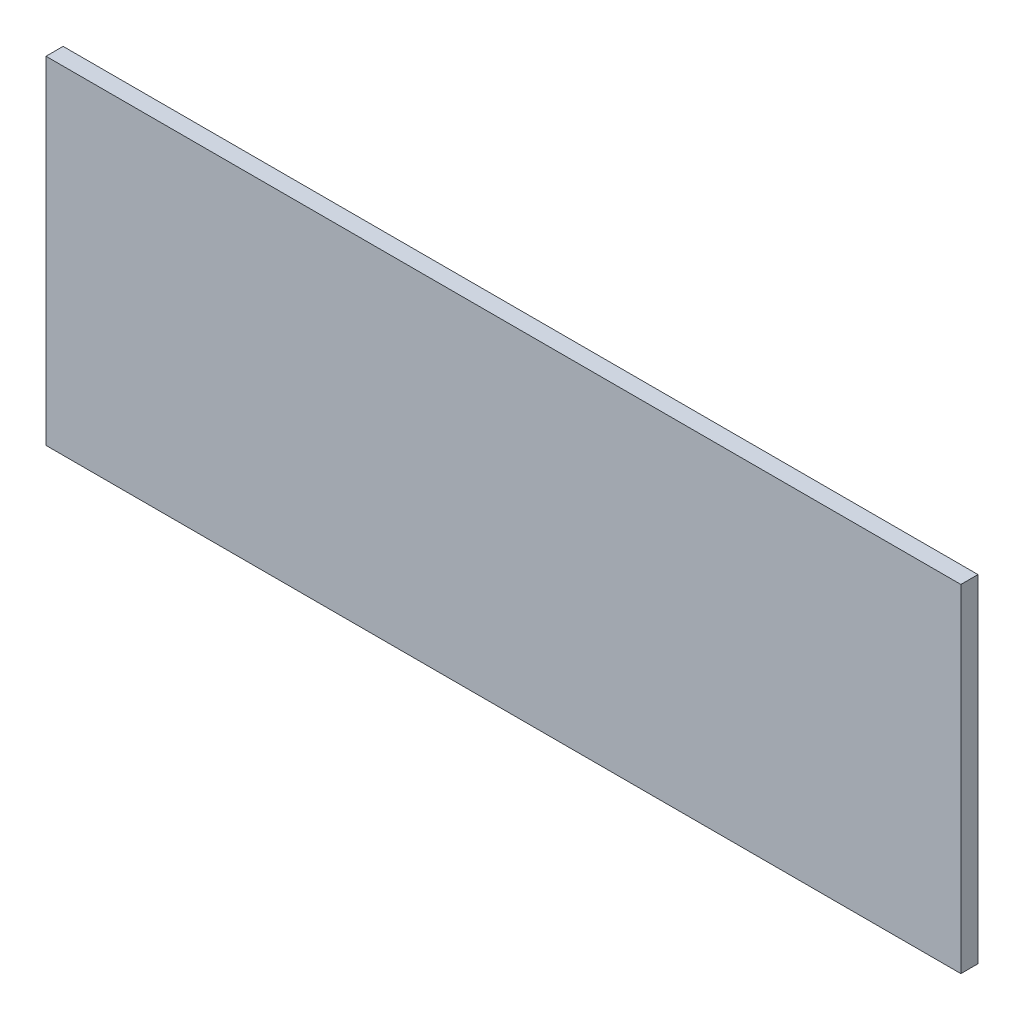
ISO-10303-21;
HEADER;
FILE_DESCRIPTION(('STEP AP214'),'2;1');
FILE_NAME('part.step','',(''),(''),'','','');
FILE_SCHEMA(('AUTOMOTIVE_DESIGN { 1 0 10303 214 1 1 1 1 }'));
ENDSEC;
DATA;
#1=APPLICATION_CONTEXT('core data for automotive mechanical design processes');
#2=APPLICATION_PROTOCOL_DEFINITION('international standard','automotive_design',2000,#1);
#3=PRODUCT_CONTEXT('',#1,'mechanical');
#4=PRODUCT('Part','Part','',(#3));
#5=PRODUCT_RELATED_PRODUCT_CATEGORY('part','',(#4));
#6=PRODUCT_DEFINITION_FORMATION('','',#4);
#7=PRODUCT_DEFINITION_CONTEXT('part definition',#1,'design');
#8=PRODUCT_DEFINITION('design','',#6,#7);
#9=PRODUCT_DEFINITION_SHAPE('','',#8);
#10=(LENGTH_UNIT() NAMED_UNIT(*) SI_UNIT(.MILLI.,.METRE.));
#11=(NAMED_UNIT(*) PLANE_ANGLE_UNIT() SI_UNIT($,.RADIAN.));
#12=(NAMED_UNIT(*) SI_UNIT($,.STERADIAN.) SOLID_ANGLE_UNIT());
#13=UNCERTAINTY_MEASURE_WITH_UNIT(LENGTH_MEASURE(1.E-05),#10,'distance_accuracy_value','');
#14=(GEOMETRIC_REPRESENTATION_CONTEXT(3) GLOBAL_UNCERTAINTY_ASSIGNED_CONTEXT((#13)) GLOBAL_UNIT_ASSIGNED_CONTEXT((#10,
#11,#12)) REPRESENTATION_CONTEXT('',''));
#15=CARTESIAN_POINT('',(0.,0.,0.));
#16=DIRECTION('',(0.,0.,1.));
#17=DIRECTION('',(1.,0.,0.));
#18=AXIS2_PLACEMENT_3D('',#15,#16,#17);
#19=CARTESIAN_POINT('',(96.5670013427734,67.5869979858398,0.));
#20=DIRECTION('',(0.,1.,0.));
#21=DIRECTION('',(1.,0.,0.));
#22=AXIS2_PLACEMENT_3D('',#19,#20,#21);
#23=PLANE('',#22);
#24=DIRECTION('',(1.,0.,0.));
#25=VECTOR('',#24,1.);
#26=CARTESIAN_POINT('',(96.5670013427734,67.5869979858398,0.03556));
#27=LINE('',#26,#25);
#28=CARTESIAN_POINT('',(96.5670013427734,67.5869979858398,0.03556));
#29=VERTEX_POINT('',#28);
#30=CARTESIAN_POINT('',(98.4670028686523,67.5869979858398,0.03556));
#31=VERTEX_POINT('',#30);
#32=EDGE_CURVE('E11',#29,#31,#27,.T.);
#33=ORIENTED_EDGE('',*,*,#32,.F.);
#34=DIRECTION('',(0.,0.,1.));
#35=VECTOR('',#34,1.);
#36=CARTESIAN_POINT('',(96.5670013427734,67.5869979858398,0.));
#37=LINE('',#36,#35);
#38=CARTESIAN_POINT('',(96.5670013427734,67.5869979858398,0.));
#39=VERTEX_POINT('',#38);
#40=EDGE_CURVE('E24',#39,#29,#37,.T.);
#41=ORIENTED_EDGE('',*,*,#40,.F.);
#42=DIRECTION('',(1.,0.,0.));
#43=VECTOR('',#42,1.);
#44=CARTESIAN_POINT('',(96.5670013427734,67.5869979858398,0.));
#45=LINE('',#44,#43);
#46=CARTESIAN_POINT('',(98.4670028686523,67.5869979858398,0.));
#47=VERTEX_POINT('',#46);
#48=EDGE_CURVE('E75',#39,#47,#45,.T.);
#49=ORIENTED_EDGE('',*,*,#48,.T.);
#50=DIRECTION('',(0.,0.,1.));
#51=VECTOR('',#50,1.);
#52=CARTESIAN_POINT('',(98.4670028686523,67.5869979858398,0.));
#53=LINE('',#52,#51);
#54=EDGE_CURVE('E37',#47,#31,#53,.T.);
#55=ORIENTED_EDGE('',*,*,#54,.T.);
#56=EDGE_LOOP('',(#33,#41,#49,#55));
#57=FACE_BOUND('',#56,.T.);
#58=ADVANCED_FACE('F17',(#57),#23,.F.);
#59=CARTESIAN_POINT('',(98.4670028686523,67.5869979858398,0.));
#60=DIRECTION('',(-1.,0.,0.));
#61=DIRECTION('',(0.,1.,0.));
#62=AXIS2_PLACEMENT_3D('',#59,#60,#61);
#63=PLANE('',#62);
#64=DIRECTION('',(0.,1.,0.));
#65=VECTOR('',#64,1.);
#66=CARTESIAN_POINT('',(98.4670028686523,67.5869979858398,0.03556));
#67=LINE('',#66,#65);
#68=CARTESIAN_POINT('',(98.4670028686523,68.2870025634766,0.03556));
#69=VERTEX_POINT('',#68);
#70=EDGE_CURVE('E83',#31,#69,#67,.T.);
#71=ORIENTED_EDGE('',*,*,#70,.F.);
#72=ORIENTED_EDGE('',*,*,#54,.F.);
#73=DIRECTION('',(0.,1.,0.));
#74=VECTOR('',#73,1.);
#75=CARTESIAN_POINT('',(98.4670028686523,67.5869979858398,0.));
#76=LINE('',#75,#74);
#77=CARTESIAN_POINT('',(98.4670028686523,68.2870025634766,0.));
#78=VERTEX_POINT('',#77);
#79=EDGE_CURVE('E81',#47,#78,#76,.T.);
#80=ORIENTED_EDGE('',*,*,#79,.T.);
#81=DIRECTION('',(0.,0.,1.));
#82=VECTOR('',#81,1.);
#83=CARTESIAN_POINT('',(98.4670028686523,68.2870025634766,0.));
#84=LINE('',#83,#82);
#85=EDGE_CURVE('E67',#78,#69,#84,.T.);
#86=ORIENTED_EDGE('',*,*,#85,.T.);
#87=EDGE_LOOP('',(#71,#72,#80,#86));
#88=FACE_BOUND('',#87,.T.);
#89=ADVANCED_FACE('F89',(#88),#63,.F.);
#90=CARTESIAN_POINT('',(98.4670028686523,68.2870025634766,0.));
#91=DIRECTION('',(0.,-1.,0.));
#92=DIRECTION('',(-1.,0.,0.));
#93=AXIS2_PLACEMENT_3D('',#90,#91,#92);
#94=PLANE('',#93);
#95=DIRECTION('',(-1.,0.,0.));
#96=VECTOR('',#95,1.);
#97=CARTESIAN_POINT('',(98.4670028686523,68.2870025634766,0.03556));
#98=LINE('',#97,#96);
#99=CARTESIAN_POINT('',(96.5670013427734,68.2870025634766,0.03556));
#100=VERTEX_POINT('',#99);
#101=EDGE_CURVE('E71',#69,#100,#98,.T.);
#102=ORIENTED_EDGE('',*,*,#101,.F.);
#103=ORIENTED_EDGE('',*,*,#85,.F.);
#104=DIRECTION('',(-1.,0.,0.));
#105=VECTOR('',#104,1.);
#106=CARTESIAN_POINT('',(98.4670028686523,68.2870025634766,0.));
#107=LINE('',#106,#105);
#108=CARTESIAN_POINT('',(96.5670013427734,68.2870025634766,0.));
#109=VERTEX_POINT('',#108);
#110=EDGE_CURVE('E63',#78,#109,#107,.T.);
#111=ORIENTED_EDGE('',*,*,#110,.T.);
#112=DIRECTION('',(0.,0.,1.));
#113=VECTOR('',#112,1.);
#114=CARTESIAN_POINT('',(96.5670013427734,68.2870025634766,0.));
#115=LINE('',#114,#113);
#116=EDGE_CURVE('E53',#109,#100,#115,.T.);
#117=ORIENTED_EDGE('',*,*,#116,.T.);
#118=EDGE_LOOP('',(#102,#103,#111,#117));
#119=FACE_BOUND('',#118,.T.);
#120=ADVANCED_FACE('F66',(#119),#94,.F.);
#121=CARTESIAN_POINT('',(96.5670013427734,68.2870025634766,0.));
#122=DIRECTION('',(1.,0.,0.));
#123=DIRECTION('',(0.,-1.,0.));
#124=AXIS2_PLACEMENT_3D('',#121,#122,#123);
#125=PLANE('',#124);
#126=DIRECTION('',(0.,-1.,0.));
#127=VECTOR('',#126,1.);
#128=CARTESIAN_POINT('',(96.5670013427734,68.2870025634766,0.03556));
#129=LINE('',#128,#127);
#130=EDGE_CURVE('E59',#100,#29,#129,.T.);
#131=ORIENTED_EDGE('',*,*,#130,.F.);
#132=ORIENTED_EDGE('',*,*,#116,.F.);
#133=DIRECTION('',(0.,-1.,0.));
#134=VECTOR('',#133,1.);
#135=CARTESIAN_POINT('',(96.5670013427734,68.2870025634766,0.));
#136=LINE('',#135,#134);
#137=EDGE_CURVE('E57',#109,#39,#136,.T.);
#138=ORIENTED_EDGE('',*,*,#137,.T.);
#139=ORIENTED_EDGE('',*,*,#40,.T.);
#140=EDGE_LOOP('',(#131,#132,#138,#139));
#141=FACE_BOUND('',#140,.T.);
#142=ADVANCED_FACE('F55',(#141),#125,.F.);
#143=CARTESIAN_POINT('',(96.5670013427734,67.5869979858398,0.));
#144=DIRECTION('',(0.,0.,-1.));
#145=DIRECTION('',(-1.,0.,0.));
#146=AXIS2_PLACEMENT_3D('',#143,#144,#145);
#147=PLANE('',#146);
#148=ORIENTED_EDGE('',*,*,#137,.F.);
#149=ORIENTED_EDGE('',*,*,#110,.F.);
#150=ORIENTED_EDGE('',*,*,#79,.F.);
#151=ORIENTED_EDGE('',*,*,#48,.F.);
#152=EDGE_LOOP('',(#148,#149,#150,#151));
#153=FACE_BOUND('',#152,.T.);
#154=ADVANCED_FACE('F74',(#153),#147,.T.);
#155=CARTESIAN_POINT('',(96.5670013427734,67.5869979858398,0.03556));
#156=DIRECTION('',(0.,0.,-1.));
#157=DIRECTION('',(-1.,0.,0.));
#158=AXIS2_PLACEMENT_3D('',#155,#156,#157);
#159=PLANE('',#158);
#160=ORIENTED_EDGE('',*,*,#32,.T.);
#161=ORIENTED_EDGE('',*,*,#70,.T.);
#162=ORIENTED_EDGE('',*,*,#101,.T.);
#163=ORIENTED_EDGE('',*,*,#130,.T.);
#164=EDGE_LOOP('',(#160,#161,#162,#163));
#165=FACE_BOUND('',#164,.T.);
#166=ADVANCED_FACE('F91',(#165),#159,.F.);
#167=CLOSED_SHELL('',(#58,#89,#120,#142,#154,#166));
#168=MANIFOLD_SOLID_BREP('B1',#167);
#169=ADVANCED_BREP_SHAPE_REPRESENTATION('',(#18,#168),#14);
#170=SHAPE_DEFINITION_REPRESENTATION(#9,#169);
ENDSEC;
END-ISO-10303-21;
